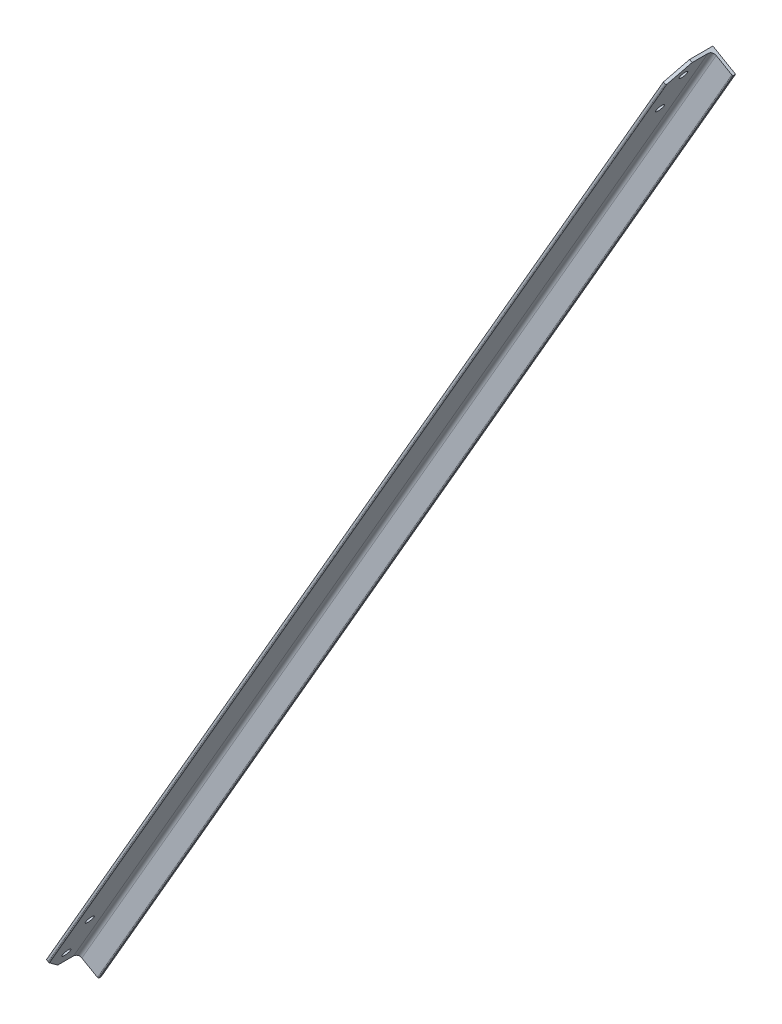
ISO-10303-21;
HEADER;
FILE_DESCRIPTION(('STEP AP214'),'2;1');
FILE_NAME('part.step','',(''),(''),'','','');
FILE_SCHEMA(('AUTOMOTIVE_DESIGN { 1 0 10303 214 1 1 1 1 }'));
ENDSEC;
DATA;
#1=APPLICATION_CONTEXT('core data for automotive mechanical design processes');
#2=APPLICATION_PROTOCOL_DEFINITION('international standard','automotive_design',2000,#1);
#3=PRODUCT_CONTEXT('',#1,'mechanical');
#4=PRODUCT('Part','Part','',(#3));
#5=PRODUCT_RELATED_PRODUCT_CATEGORY('part','',(#4));
#6=PRODUCT_DEFINITION_FORMATION('','',#4);
#7=PRODUCT_DEFINITION_CONTEXT('part definition',#1,'design');
#8=PRODUCT_DEFINITION('design','',#6,#7);
#9=PRODUCT_DEFINITION_SHAPE('','',#8);
#10=(LENGTH_UNIT() NAMED_UNIT(*) SI_UNIT(.MILLI.,.METRE.));
#11=(NAMED_UNIT(*) PLANE_ANGLE_UNIT() SI_UNIT($,.RADIAN.));
#12=(NAMED_UNIT(*) SI_UNIT($,.STERADIAN.) SOLID_ANGLE_UNIT());
#13=UNCERTAINTY_MEASURE_WITH_UNIT(LENGTH_MEASURE(1.E-05),#10,'distance_accuracy_value','');
#14=(GEOMETRIC_REPRESENTATION_CONTEXT(3) GLOBAL_UNCERTAINTY_ASSIGNED_CONTEXT((#13)) GLOBAL_UNIT_ASSIGNED_CONTEXT((#10,
#11,#12)) REPRESENTATION_CONTEXT('',''));
#15=CARTESIAN_POINT('',(0.,0.,0.));
#16=DIRECTION('',(0.,0.,1.));
#17=DIRECTION('',(1.,0.,0.));
#18=AXIS2_PLACEMENT_3D('',#15,#16,#17);
#19=CARTESIAN_POINT('',(2.88386459460233,-1.66499999999958,70.));
#20=DIRECTION('',(0.,0.,-1.));
#21=DIRECTION('',(-1.,0.,0.));
#22=AXIS2_PLACEMENT_3D('',#19,#20,#21);
#23=PLANE('',#22);
#24=DIRECTION('',(0.499999999999998,0.86602540378444,0.));
#25=VECTOR('',#24,1.);
#26=CARTESIAN_POINT('',(2.22044604925031E-13,4.44089209850063E-13,70.));
#27=LINE('',#26,#25);
#28=CARTESIAN_POINT('',(15.0000000000001,25.9807621135336,70.));
#29=VERTEX_POINT('',#28);
#30=CARTESIAN_POINT('',(1075.,1861.95461813655,70.));
#31=VERTEX_POINT('',#30);
#32=EDGE_CURVE('E167',#29,#31,#27,.T.);
#33=ORIENTED_EDGE('',*,*,#32,.F.);
#34=DIRECTION('',(0.86602540378444,-0.499999999999998,0.));
#35=VECTOR('',#34,1.);
#36=CARTESIAN_POINT('',(17.8838645946023,24.3157621135336,70.));
#37=LINE('',#36,#35);
#38=CARTESIAN_POINT('',(17.8838645946023,24.3157621135337,70.));
#39=VERTEX_POINT('',#38);
#40=EDGE_CURVE('E88',#29,#39,#37,.T.);
#41=ORIENTED_EDGE('',*,*,#40,.T.);
#42=DIRECTION('',(0.499999999999998,0.86602540378444,0.));
#43=VECTOR('',#42,1.);
#44=CARTESIAN_POINT('',(2.88386459460233,-1.66499999999958,70.));
#45=LINE('',#44,#43);
#46=CARTESIAN_POINT('',(1077.8838645946,1860.28961813655,70.));
#47=VERTEX_POINT('',#46);
#48=EDGE_CURVE('E186',#39,#47,#45,.T.);
#49=ORIENTED_EDGE('',*,*,#48,.T.);
#50=DIRECTION('',(-0.86602540378444,0.499999999999998,0.));
#51=VECTOR('',#50,1.);
#52=CARTESIAN_POINT('',(1077.8838645946,1860.28961813655,70.));
#53=LINE('',#52,#51);
#54=EDGE_CURVE('E218',#47,#31,#53,.T.);
#55=ORIENTED_EDGE('',*,*,#54,.T.);
#56=EDGE_LOOP('',(#33,#41,#49,#55));
#57=FACE_BOUND('',#56,.T.);
#58=ADVANCED_FACE('F66',(#57),#23,.F.);
#59=CARTESIAN_POINT('',(2.22044604925031E-13,4.44089209850063E-13,70.));
#60=DIRECTION('',(0.86602540378444,-0.499999999999998,0.));
#61=DIRECTION('',(0.499999999999998,0.86602540378444,0.));
#62=AXIS2_PLACEMENT_3D('',#59,#60,#61);
#63=PLANE('',#62);
#64=CARTESIAN_POINT('',(1035.,1792.67258583379,40.0047232344756));
#65=DIRECTION('',(-0.86602540378444,0.499999999999998,0.));
#66=DIRECTION('',(-0.499999999999998,-0.86602540378444,0.));
#67=AXIS2_PLACEMENT_3D('',#64,#65,#66);
#68=CIRCLE('',#67,7.00000000000019);
#69=CARTESIAN_POINT('',(1031.5,1786.6104080073,40.0047232344756));
#70=VERTEX_POINT('',#69);
#71=EDGE_CURVE('E456',#70,#70,#68,.T.);
#72=ORIENTED_EDGE('',*,*,#71,.F.);
#73=EDGE_LOOP('',(#72));
#74=FACE_BOUND('',#73,.T.);
#75=CARTESIAN_POINT('',(1075.,1861.95461813655,40.0047232344756));
#76=DIRECTION('',(-0.86602540378444,0.499999999999998,0.));
#77=DIRECTION('',(-0.499999999999998,-0.86602540378444,0.));
#78=AXIS2_PLACEMENT_3D('',#75,#76,#77);
#79=CIRCLE('',#78,6.9999999999998);
#80=CARTESIAN_POINT('',(1071.5,1855.89244031006,40.0047232344756));
#81=VERTEX_POINT('',#80);
#82=EDGE_CURVE('E457',#81,#81,#79,.T.);
#83=ORIENTED_EDGE('',*,*,#82,.F.);
#84=EDGE_LOOP('',(#83));
#85=FACE_BOUND('',#84,.T.);
#86=CARTESIAN_POINT('',(15.0000000000002,25.9807621135336,40.));
#87=DIRECTION('',(-0.86602540378444,0.499999999999998,0.));
#88=DIRECTION('',(-0.499999999999998,-0.86602540378444,0.));
#89=AXIS2_PLACEMENT_3D('',#86,#87,#88);
#90=CIRCLE('',#89,7.);
#91=CARTESIAN_POINT('',(11.5000000000002,19.9185842870425,40.));
#92=VERTEX_POINT('',#91);
#93=EDGE_CURVE('E445',#92,#92,#90,.T.);
#94=ORIENTED_EDGE('',*,*,#93,.F.);
#95=EDGE_LOOP('',(#94));
#96=FACE_BOUND('',#95,.T.);
#97=CARTESIAN_POINT('',(55.,95.2627944162888,40.));
#98=DIRECTION('',(-0.86602540378444,0.499999999999998,0.));
#99=DIRECTION('',(-0.499999999999998,-0.86602540378444,0.));
#100=AXIS2_PLACEMENT_3D('',#97,#98,#99);
#101=CIRCLE('',#100,7.);
#102=CARTESIAN_POINT('',(51.5,89.2006165897977,40.));
#103=VERTEX_POINT('',#102);
#104=EDGE_CURVE('E440',#103,#103,#101,.T.);
#105=ORIENTED_EDGE('',*,*,#104,.F.);
#106=EDGE_LOOP('',(#105));
#107=FACE_BOUND('',#106,.T.);
#108=DIRECTION('',(0.,0.,-1.));
#109=VECTOR('',#108,1.);
#110=CARTESIAN_POINT('',(2.22044604925031E-13,4.44089209850063E-13,70.));
#111=LINE('',#110,#109);
#112=CARTESIAN_POINT('',(2.22044604925031E-13,4.44089209850063E-13,40.0000000000002));
#113=VERTEX_POINT('',#112);
#114=CARTESIAN_POINT('',(2.22044604925031E-13,4.44089209850063E-13,0.));
#115=VERTEX_POINT('',#114);
#116=EDGE_CURVE('E148',#113,#115,#111,.T.);
#117=ORIENTED_EDGE('',*,*,#116,.F.);
#118=DIRECTION('',(0.353553390593273,0.612372435695796,0.707106781186546));
#119=VECTOR('',#118,1.);
#120=CARTESIAN_POINT('',(2.63677968348475E-13,5.20417042793042E-13,40.0000000000002));
#121=LINE('',#120,#119);
#122=EDGE_CURVE('E232',#113,#29,#121,.T.);
#123=ORIENTED_EDGE('',*,*,#122,.T.);
#124=ORIENTED_EDGE('',*,*,#32,.T.);
#125=DIRECTION('',(-0.353553390593271,-0.612372435695793,0.707106781186551));
#126=VECTOR('',#125,1.);
#127=CARTESIAN_POINT('',(1075.,1861.95461813655,70.));
#128=LINE('',#127,#126);
#129=CARTESIAN_POINT('',(1090.,1887.93538025008,39.9999999999995));
#130=VERTEX_POINT('',#129);
#131=EDGE_CURVE('E221',#31,#130,#128,.F.);
#132=ORIENTED_EDGE('',*,*,#131,.T.);
#133=DIRECTION('',(0.,0.,-1.));
#134=VECTOR('',#133,1.);
#135=CARTESIAN_POINT('',(1090.,1887.93538025008,70.));
#136=LINE('',#135,#134);
#137=CARTESIAN_POINT('',(1090.,1887.93538025008,0.));
#138=VERTEX_POINT('',#137);
#139=EDGE_CURVE('E164',#130,#138,#136,.T.);
#140=ORIENTED_EDGE('',*,*,#139,.T.);
#141=DIRECTION('',(0.499999999999998,0.86602540378444,0.));
#142=VECTOR('',#141,1.);
#143=CARTESIAN_POINT('',(2.22044604925031E-13,4.44089209850063E-13,0.));
#144=LINE('',#143,#142);
#145=EDGE_CURVE('E161',#115,#138,#144,.T.);
#146=ORIENTED_EDGE('',*,*,#145,.F.);
#147=EDGE_LOOP('',(#117,#123,#124,#132,#140,#146));
#148=FACE_BOUND('',#147,.T.);
#149=ADVANCED_FACE('F162',(#74,#85,#96,#107,#148),#63,.F.);
#150=CARTESIAN_POINT('',(2.22044604925031E-13,4.44089209850063E-13,0.));
#151=DIRECTION('',(0.,0.,1.));
#152=DIRECTION('',(1.,0.,0.));
#153=AXIS2_PLACEMENT_3D('',#150,#151,#152);
#154=PLANE('',#153);
#155=DIRECTION('',(0.866025403784439,-0.5,0.));
#156=VECTOR('',#155,1.);
#157=CARTESIAN_POINT('',(1090.,1887.93538025008,0.));
#158=LINE('',#157,#156);
#159=CARTESIAN_POINT('',(1128.9711431703,1865.43538025008,0.));
#160=VERTEX_POINT('',#159);
#161=EDGE_CURVE('E188',#138,#160,#158,.T.);
#162=ORIENTED_EDGE('',*,*,#161,.T.);
#163=DIRECTION('',(0.499999999999998,0.86602540378444,0.));
#164=VECTOR('',#163,1.);
#165=CARTESIAN_POINT('',(38.9711431702999,-22.4999999999995,0.));
#166=LINE('',#165,#164);
#167=CARTESIAN_POINT('',(38.9711431702999,-22.4999999999995,0.));
#168=VERTEX_POINT('',#167);
#169=EDGE_CURVE('E168',#168,#160,#166,.T.);
#170=ORIENTED_EDGE('',*,*,#169,.F.);
#171=DIRECTION('',(0.866025403784439,-0.5,0.));
#172=VECTOR('',#171,1.);
#173=CARTESIAN_POINT('',(2.22044604925031E-13,4.44089209850063E-13,0.));
#174=LINE('',#173,#172);
#175=EDGE_CURVE('E153',#115,#168,#174,.T.);
#176=ORIENTED_EDGE('',*,*,#175,.F.);
#177=ORIENTED_EDGE('',*,*,#145,.T.);
#178=EDGE_LOOP('',(#162,#170,#176,#177));
#179=FACE_BOUND('',#178,.T.);
#180=ADVANCED_FACE('F170',(#179),#154,.F.);
#181=CARTESIAN_POINT('',(38.9711431702999,-22.4999999999995,0.));
#182=DIRECTION('',(-0.86602540378444,0.499999999999998,0.));
#183=DIRECTION('',(-0.499999999999998,-0.86602540378444,0.));
#184=AXIS2_PLACEMENT_3D('',#181,#182,#183);
#185=PLANE('',#184);
#186=DIRECTION('',(0.,0.,1.));
#187=VECTOR('',#186,1.);
#188=CARTESIAN_POINT('',(1128.9711431703,1865.43538025008,0.));
#189=LINE('',#188,#187);
#190=CARTESIAN_POINT('',(1128.9711431703,1865.43538025008,3.33));
#191=VERTEX_POINT('',#190);
#192=EDGE_CURVE('E191',#160,#191,#189,.T.);
#193=ORIENTED_EDGE('',*,*,#192,.T.);
#194=DIRECTION('',(0.499999999999998,0.86602540378444,0.));
#195=VECTOR('',#194,1.);
#196=CARTESIAN_POINT('',(38.9711431702999,-22.4999999999995,3.33));
#197=LINE('',#196,#195);
#198=CARTESIAN_POINT('',(38.9711431702999,-22.4999999999995,3.33));
#199=VERTEX_POINT('',#198);
#200=EDGE_CURVE('E213',#199,#191,#197,.T.);
#201=ORIENTED_EDGE('',*,*,#200,.F.);
#202=DIRECTION('',(0.,0.,1.));
#203=VECTOR('',#202,1.);
#204=CARTESIAN_POINT('',(38.9711431702999,-22.4999999999995,0.));
#205=LINE('',#204,#203);
#206=EDGE_CURVE('E173',#168,#199,#205,.T.);
#207=ORIENTED_EDGE('',*,*,#206,.F.);
#208=ORIENTED_EDGE('',*,*,#169,.T.);
#209=EDGE_LOOP('',(#193,#201,#207,#208));
#210=FACE_BOUND('',#209,.T.);
#211=ADVANCED_FACE('F383',(#210),#185,.F.);
#212=CARTESIAN_POINT('',(37.52488074598,-21.6649999999994,3.33));
#213=DIRECTION('',(0.499999999999998,0.86602540378444,0.));
#214=DIRECTION('',(-0.86602540378444,0.499999999999998,0.));
#215=AXIS2_PLACEMENT_3D('',#212,#213,#214);
#216=CYLINDRICAL_SURFACE('',#215,1.66999999999998);
#217=CARTESIAN_POINT('',(1127.52488074598,1866.27038025008,3.33));
#218=DIRECTION('',(-0.499999999999998,-0.86602540378444,0.));
#219=DIRECTION('',(0.86602540378444,-0.499999999999998,0.));
#220=AXIS2_PLACEMENT_3D('',#217,#218,#219);
#221=CIRCLE('',#220,1.66999999999998);
#222=CARTESIAN_POINT('',(1127.52488074598,1866.27038025008,4.99999999999998));
#223=VERTEX_POINT('',#222);
#224=EDGE_CURVE('E193',#191,#223,#221,.T.);
#225=ORIENTED_EDGE('',*,*,#224,.T.);
#226=DIRECTION('',(0.499999999999998,0.86602540378444,0.));
#227=VECTOR('',#226,1.);
#228=CARTESIAN_POINT('',(37.52488074598,-21.6649999999994,4.99999999999998));
#229=LINE('',#228,#227);
#230=CARTESIAN_POINT('',(37.52488074598,-21.6649999999994,4.99999999999998));
#231=VERTEX_POINT('',#230);
#232=EDGE_CURVE('E210',#231,#223,#229,.T.);
#233=ORIENTED_EDGE('',*,*,#232,.F.);
#234=CARTESIAN_POINT('',(37.52488074598,-21.6649999999994,3.33));
#235=DIRECTION('',(-0.499999999999998,-0.86602540378444,0.));
#236=DIRECTION('',(0.86602540378444,-0.499999999999998,0.));
#237=AXIS2_PLACEMENT_3D('',#234,#235,#236);
#238=CIRCLE('',#237,1.66999999999998);
#239=EDGE_CURVE('E175',#199,#231,#238,.T.);
#240=ORIENTED_EDGE('',*,*,#239,.F.);
#241=ORIENTED_EDGE('',*,*,#200,.T.);
#242=EDGE_LOOP('',(#225,#233,#240,#241));
#243=FACE_BOUND('',#242,.T.);
#244=ADVANCED_FACE('F391',(#243),#216,.T.);
#245=CARTESIAN_POINT('',(37.52488074598,-21.6649999999994,5.));
#246=DIRECTION('',(0.,0.,-1.));
#247=DIRECTION('',(-1.,0.,0.));
#248=AXIS2_PLACEMENT_3D('',#245,#246,#247);
#249=PLANE('',#248);
#250=DIRECTION('',(-0.86602540378444,0.499999999999997,0.));
#251=VECTOR('',#250,1.);
#252=CARTESIAN_POINT('',(1127.52488074598,1866.27038025008,5.));
#253=LINE('',#252,#251);
#254=CARTESIAN_POINT('',(1100.8253175473,1881.68538025008,5.));
#255=VERTEX_POINT('',#254);
#256=EDGE_CURVE('E195',#223,#255,#253,.T.);
#257=ORIENTED_EDGE('',*,*,#256,.T.);
#258=DIRECTION('',(0.499999999999998,0.86602540378444,0.));
#259=VECTOR('',#258,1.);
#260=CARTESIAN_POINT('',(10.8253175473056,-6.24999999999942,5.));
#261=LINE('',#260,#259);
#262=CARTESIAN_POINT('',(10.8253175473056,-6.24999999999942,5.));
#263=VERTEX_POINT('',#262);
#264=EDGE_CURVE('E207',#263,#255,#261,.T.);
#265=ORIENTED_EDGE('',*,*,#264,.F.);
#266=DIRECTION('',(-0.86602540378444,0.499999999999997,0.));
#267=VECTOR('',#266,1.);
#268=CARTESIAN_POINT('',(37.52488074598,-21.6649999999994,5.));
#269=LINE('',#268,#267);
#270=EDGE_CURVE('E180',#231,#263,#269,.T.);
#271=ORIENTED_EDGE('',*,*,#270,.F.);
#272=ORIENTED_EDGE('',*,*,#232,.T.);
#273=EDGE_LOOP('',(#257,#265,#271,#272));
#274=FACE_BOUND('',#273,.T.);
#275=ADVANCED_FACE('F401',(#274),#249,.F.);
#276=CARTESIAN_POINT('',(10.8253175473056,-6.24999999999942,12.5));
#277=DIRECTION('',(0.499999999999998,0.86602540378444,0.));
#278=DIRECTION('',(-0.86602540378444,0.499999999999998,0.));
#279=AXIS2_PLACEMENT_3D('',#276,#277,#278);
#280=CYLINDRICAL_SURFACE('',#279,7.49999999999995);
#281=CARTESIAN_POINT('',(1100.8253175473,1881.68538025008,12.5));
#282=DIRECTION('',(0.499999999999998,0.86602540378444,0.));
#283=DIRECTION('',(-0.86602540378444,0.499999999999998,0.));
#284=AXIS2_PLACEMENT_3D('',#281,#282,#283);
#285=CIRCLE('',#284,7.49999999999995);
#286=CARTESIAN_POINT('',(1094.33012701892,1885.43538025008,12.5));
#287=VERTEX_POINT('',#286);
#288=EDGE_CURVE('E197',#255,#287,#285,.T.);
#289=ORIENTED_EDGE('',*,*,#288,.T.);
#290=DIRECTION('',(0.499999999999998,0.86602540378444,0.));
#291=VECTOR('',#290,1.);
#292=CARTESIAN_POINT('',(4.33012701892244,-2.4999999999995,12.5));
#293=LINE('',#292,#291);
#294=CARTESIAN_POINT('',(4.33012701892244,-2.4999999999995,12.5));
#295=VERTEX_POINT('',#294);
#296=EDGE_CURVE('E204',#295,#287,#293,.T.);
#297=ORIENTED_EDGE('',*,*,#296,.F.);
#298=CARTESIAN_POINT('',(10.8253175473056,-6.24999999999942,12.5));
#299=DIRECTION('',(0.499999999999998,0.86602540378444,0.));
#300=DIRECTION('',(-0.86602540378444,0.499999999999998,0.));
#301=AXIS2_PLACEMENT_3D('',#298,#299,#300);
#302=CIRCLE('',#301,7.49999999999995);
#303=EDGE_CURVE('E182',#263,#295,#302,.T.);
#304=ORIENTED_EDGE('',*,*,#303,.F.);
#305=ORIENTED_EDGE('',*,*,#264,.T.);
#306=EDGE_LOOP('',(#289,#297,#304,#305));
#307=FACE_BOUND('',#306,.T.);
#308=ADVANCED_FACE('F246',(#307),#280,.F.);
#309=CARTESIAN_POINT('',(4.33012701892244,-2.4999999999995,12.5));
#310=DIRECTION('',(-0.86602540378444,0.499999999999998,0.));
#311=DIRECTION('',(-0.499999999999998,-0.86602540378444,0.));
#312=AXIS2_PLACEMENT_3D('',#309,#310,#311);
#313=PLANE('',#312);
#314=CARTESIAN_POINT('',(1039.33012701892,1790.17258583379,40.0047232344756));
#315=DIRECTION('',(-0.86602540378444,0.499999999999998,0.));
#316=DIRECTION('',(-0.499999999999998,-0.86602540378444,0.));
#317=AXIS2_PLACEMENT_3D('',#314,#315,#316);
#318=CIRCLE('',#317,7.00000000000019);
#319=CARTESIAN_POINT('',(1035.83012701892,1784.1104080073,40.0047232344756));
#320=VERTEX_POINT('',#319);
#321=EDGE_CURVE('E448',#320,#320,#318,.F.);
#322=ORIENTED_EDGE('',*,*,#321,.F.);
#323=EDGE_LOOP('',(#322));
#324=FACE_BOUND('',#323,.T.);
#325=CARTESIAN_POINT('',(1079.33012701892,1859.45461813655,40.0047232344756));
#326=DIRECTION('',(-0.86602540378444,0.499999999999998,0.));
#327=DIRECTION('',(-0.499999999999998,-0.86602540378444,0.));
#328=AXIS2_PLACEMENT_3D('',#325,#326,#327);
#329=CIRCLE('',#328,6.9999999999998);
#330=CARTESIAN_POINT('',(1075.83012701892,1853.39244031006,40.0047232344756));
#331=VERTEX_POINT('',#330);
#332=EDGE_CURVE('E453',#331,#331,#329,.F.);
#333=ORIENTED_EDGE('',*,*,#332,.F.);
#334=EDGE_LOOP('',(#333));
#335=FACE_BOUND('',#334,.T.);
#336=CARTESIAN_POINT('',(19.3301270189222,23.4807621135337,40.));
#337=DIRECTION('',(-0.86602540378444,0.499999999999998,0.));
#338=DIRECTION('',(-0.499999999999998,-0.86602540378444,0.));
#339=AXIS2_PLACEMENT_3D('',#336,#337,#338);
#340=CIRCLE('',#339,7.);
#341=CARTESIAN_POINT('',(15.8301270189222,17.4185842870426,40.));
#342=VERTEX_POINT('',#341);
#343=EDGE_CURVE('E189',#342,#342,#340,.F.);
#344=ORIENTED_EDGE('',*,*,#343,.F.);
#345=EDGE_LOOP('',(#344));
#346=FACE_BOUND('',#345,.T.);
#347=CARTESIAN_POINT('',(59.3301270189222,92.7627944162889,40.));
#348=DIRECTION('',(-0.86602540378444,0.499999999999998,0.));
#349=DIRECTION('',(-0.499999999999998,-0.86602540378444,0.));
#350=AXIS2_PLACEMENT_3D('',#347,#348,#349);
#351=CIRCLE('',#350,7.);
#352=CARTESIAN_POINT('',(55.8301270189222,86.7006165897978,40.));
#353=VERTEX_POINT('',#352);
#354=EDGE_CURVE('E443',#353,#353,#351,.F.);
#355=ORIENTED_EDGE('',*,*,#354,.F.);
#356=EDGE_LOOP('',(#355));
#357=FACE_BOUND('',#356,.T.);
#358=DIRECTION('',(0.499999999999998,0.86602540378444,0.));
#359=VECTOR('',#358,1.);
#360=CARTESIAN_POINT('',(4.33012701892244,-2.4999999999995,68.33));
#361=LINE('',#360,#359);
#362=CARTESIAN_POINT('',(18.4951270189223,22.0344996892136,68.33));
#363=VERTEX_POINT('',#362);
#364=CARTESIAN_POINT('',(1080.16512701892,1860.90088056087,68.33));
#365=VERTEX_POINT('',#364);
#366=EDGE_CURVE('E202',#363,#365,#361,.T.);
#367=ORIENTED_EDGE('',*,*,#366,.F.);
#368=DIRECTION('',(-0.353553390593273,-0.612372435695796,-0.707106781186546));
#369=VECTOR('',#368,1.);
#370=CARTESIAN_POINT('',(4.33012701892245,-2.49999999999946,40.0000000000002));
#371=LINE('',#370,#369);
#372=CARTESIAN_POINT('',(4.33012701892244,-2.4999999999995,40.0000000000002));
#373=VERTEX_POINT('',#372);
#374=EDGE_CURVE('E13',#363,#373,#371,.T.);
#375=ORIENTED_EDGE('',*,*,#374,.T.);
#376=DIRECTION('',(0.,0.,1.));
#377=VECTOR('',#376,1.);
#378=CARTESIAN_POINT('',(4.33012701892244,-2.4999999999995,12.5));
#379=LINE('',#378,#377);
#380=EDGE_CURVE('E184',#295,#373,#379,.T.);
#381=ORIENTED_EDGE('',*,*,#380,.F.);
#382=ORIENTED_EDGE('',*,*,#296,.T.);
#383=DIRECTION('',(0.,0.,1.));
#384=VECTOR('',#383,1.);
#385=CARTESIAN_POINT('',(1094.33012701892,1885.43538025008,12.5));
#386=LINE('',#385,#384);
#387=CARTESIAN_POINT('',(1094.33012701892,1885.43538025008,39.9999999999995));
#388=VERTEX_POINT('',#387);
#389=EDGE_CURVE('E158',#287,#388,#386,.T.);
#390=ORIENTED_EDGE('',*,*,#389,.T.);
#391=DIRECTION('',(0.353553390593271,0.612372435695793,-0.707106781186551));
#392=VECTOR('',#391,1.);
#393=CARTESIAN_POINT('',(1079.33012701892,1859.45461813655,70.));
#394=LINE('',#393,#392);
#395=EDGE_CURVE('E225',#388,#365,#394,.F.);
#396=ORIENTED_EDGE('',*,*,#395,.T.);
#397=EDGE_LOOP('',(#367,#375,#381,#382,#390,#396));
#398=FACE_BOUND('',#397,.T.);
#399=ADVANCED_FACE('F240',(#324,#335,#346,#357,#398),#313,.F.);
#400=CARTESIAN_POINT('',(2.88386459460233,-1.66499999999958,68.33));
#401=DIRECTION('',(0.499999999999998,0.86602540378444,0.));
#402=DIRECTION('',(-0.86602540378444,0.499999999999998,0.));
#403=AXIS2_PLACEMENT_3D('',#400,#401,#402);
#404=CYLINDRICAL_SURFACE('',#403,1.67000000000002);
#405=ORIENTED_EDGE('',*,*,#48,.F.);
#406=CARTESIAN_POINT('',(17.0488645946023,22.8694996892136,68.33));
#407=DIRECTION('',(-0.353553390593272,-0.612372435695795,0.707106781186548));
#408=DIRECTION('',(0.353553390593273,0.612372435695796,0.707106781186547));
#409=AXIS2_PLACEMENT_3D('',#406,#407,#408);
#410=ELLIPSE('',#409,2.36173664916311,1.67000000000002);
#411=EDGE_CURVE('E74',#39,#363,#410,.F.);
#412=ORIENTED_EDGE('',*,*,#411,.T.);
#413=ORIENTED_EDGE('',*,*,#366,.T.);
#414=CARTESIAN_POINT('',(1078.7188645946,1861.73588056087,68.33));
#415=DIRECTION('',(-0.353553390593274,-0.612372435695798,-0.707106781186544));
#416=DIRECTION('',(0.353553390593271,0.612372435695793,-0.707106781186551));
#417=AXIS2_PLACEMENT_3D('',#414,#415,#416);
#418=ELLIPSE('',#417,2.36173664916309,1.67000000000002);
#419=EDGE_CURVE('E228',#365,#47,#418,.T.);
#420=ORIENTED_EDGE('',*,*,#419,.T.);
#421=EDGE_LOOP('',(#405,#412,#413,#420));
#422=FACE_BOUND('',#421,.T.);
#423=ADVANCED_FACE('F257',(#422),#404,.T.);
#424=CARTESIAN_POINT('',(37.52488074598,-21.6649999999994,3.33));
#425=DIRECTION('',(-0.499999999999998,-0.86602540378444,0.));
#426=DIRECTION('',(0.86602540378444,-0.499999999999998,0.));
#427=AXIS2_PLACEMENT_3D('',#424,#425,#426);
#428=PLANE('',#427);
#429=ORIENTED_EDGE('',*,*,#380,.T.);
#430=DIRECTION('',(-0.86602540378444,0.499999999999998,0.));
#431=VECTOR('',#430,1.);
#432=CARTESIAN_POINT('',(2.65412691824451E-13,5.17412413595568E-13,40.0000000000002));
#433=LINE('',#432,#431);
#434=EDGE_CURVE('E156',#373,#113,#433,.T.);
#435=ORIENTED_EDGE('',*,*,#434,.T.);
#436=ORIENTED_EDGE('',*,*,#116,.T.);
#437=ORIENTED_EDGE('',*,*,#175,.T.);
#438=ORIENTED_EDGE('',*,*,#206,.T.);
#439=ORIENTED_EDGE('',*,*,#239,.T.);
#440=ORIENTED_EDGE('',*,*,#270,.T.);
#441=ORIENTED_EDGE('',*,*,#303,.T.);
#442=EDGE_LOOP('',(#429,#435,#436,#437,#438,#439,#440,#441));
#443=FACE_BOUND('',#442,.T.);
#444=ADVANCED_FACE('F151',(#443),#428,.T.);
#445=CARTESIAN_POINT('',(1127.52488074598,1866.27038025008,3.33));
#446=DIRECTION('',(-0.499999999999998,-0.86602540378444,0.));
#447=DIRECTION('',(0.86602540378444,-0.499999999999998,0.));
#448=AXIS2_PLACEMENT_3D('',#445,#446,#447);
#449=PLANE('',#448);
#450=ORIENTED_EDGE('',*,*,#139,.F.);
#451=DIRECTION('',(0.86602540378444,-0.499999999999998,0.));
#452=VECTOR('',#451,1.);
#453=CARTESIAN_POINT('',(1127.52488074598,1866.27038025008,39.9999999999995));
#454=LINE('',#453,#452);
#455=EDGE_CURVE('E223',#130,#388,#454,.T.);
#456=ORIENTED_EDGE('',*,*,#455,.T.);
#457=ORIENTED_EDGE('',*,*,#389,.F.);
#458=ORIENTED_EDGE('',*,*,#288,.F.);
#459=ORIENTED_EDGE('',*,*,#256,.F.);
#460=ORIENTED_EDGE('',*,*,#224,.F.);
#461=ORIENTED_EDGE('',*,*,#192,.F.);
#462=ORIENTED_EDGE('',*,*,#161,.F.);
#463=EDGE_LOOP('',(#450,#456,#457,#458,#459,#460,#461,#462));
#464=FACE_BOUND('',#463,.T.);
#465=ADVANCED_FACE('F251',(#464),#449,.F.);
#466=CARTESIAN_POINT('',(911.472326183001,-399.221733658929,40.));
#467=DIRECTION('',(-0.86602540378444,0.499999999999998,0.));
#468=DIRECTION('',(-0.499999999999998,-0.86602540378444,0.));
#469=AXIS2_PLACEMENT_3D('',#466,#467,#468);
#470=CYLINDRICAL_SURFACE('',#469,7.);
#471=ORIENTED_EDGE('',*,*,#104,.T.);
#472=EDGE_LOOP('',(#471));
#473=FACE_BOUND('',#472,.T.);
#474=ORIENTED_EDGE('',*,*,#354,.T.);
#475=EDGE_LOOP('',(#474));
#476=FACE_BOUND('',#475,.T.);
#477=ADVANCED_FACE('F296',(#473,#476),#470,.F.);
#478=CARTESIAN_POINT('',(871.472326183001,-468.503765961684,40.));
#479=DIRECTION('',(-0.86602540378444,0.499999999999998,0.));
#480=DIRECTION('',(-0.499999999999998,-0.86602540378444,0.));
#481=AXIS2_PLACEMENT_3D('',#478,#479,#480);
#482=CYLINDRICAL_SURFACE('',#481,7.);
#483=ORIENTED_EDGE('',*,*,#93,.T.);
#484=EDGE_LOOP('',(#483));
#485=FACE_BOUND('',#484,.T.);
#486=ORIENTED_EDGE('',*,*,#343,.T.);
#487=EDGE_LOOP('',(#486));
#488=FACE_BOUND('',#487,.T.);
#489=ADVANCED_FACE('F288',(#485,#488),#482,.F.);
#490=CARTESIAN_POINT('',(1931.472326183,1367.47009006133,40.0047232344756));
#491=DIRECTION('',(-0.86602540378444,0.499999999999998,0.));
#492=DIRECTION('',(-0.499999999999998,-0.86602540378444,0.));
#493=AXIS2_PLACEMENT_3D('',#490,#491,#492);
#494=CYLINDRICAL_SURFACE('',#493,6.9999999999998);
#495=ORIENTED_EDGE('',*,*,#82,.T.);
#496=EDGE_LOOP('',(#495));
#497=FACE_BOUND('',#496,.T.);
#498=ORIENTED_EDGE('',*,*,#332,.T.);
#499=EDGE_LOOP('',(#498));
#500=FACE_BOUND('',#499,.T.);
#501=ADVANCED_FACE('F282',(#497,#500),#494,.F.);
#502=CARTESIAN_POINT('',(1891.472326183,1298.18805775857,40.0047232344756));
#503=DIRECTION('',(-0.86602540378444,0.499999999999998,0.));
#504=DIRECTION('',(-0.499999999999998,-0.86602540378444,0.));
#505=AXIS2_PLACEMENT_3D('',#502,#503,#504);
#506=CYLINDRICAL_SURFACE('',#505,7.00000000000019);
#507=ORIENTED_EDGE('',*,*,#71,.T.);
#508=EDGE_LOOP('',(#507));
#509=FACE_BOUND('',#508,.T.);
#510=ORIENTED_EDGE('',*,*,#321,.T.);
#511=EDGE_LOOP('',(#510));
#512=FACE_BOUND('',#511,.T.);
#513=ADVANCED_FACE('F277',(#509,#512),#506,.F.);
#514=CARTESIAN_POINT('',(1077.8838645946,1860.28961813655,70.));
#515=DIRECTION('',(-0.353553390593274,-0.612372435695798,-0.707106781186544));
#516=DIRECTION('',(-0.86602540378444,0.499999999999998,0.));
#517=AXIS2_PLACEMENT_3D('',#514,#515,#516);
#518=PLANE('',#517);
#519=ORIENTED_EDGE('',*,*,#395,.F.);
#520=ORIENTED_EDGE('',*,*,#455,.F.);
#521=ORIENTED_EDGE('',*,*,#131,.F.);
#522=ORIENTED_EDGE('',*,*,#54,.F.);
#523=ORIENTED_EDGE('',*,*,#419,.F.);
#524=EDGE_LOOP('',(#519,#520,#521,#522,#523));
#525=FACE_BOUND('',#524,.T.);
#526=ADVANCED_FACE('F255',(#525),#518,.F.);
#527=CARTESIAN_POINT('',(37.52488074598,-21.6649999999994,40.0000000000002));
#528=DIRECTION('',(-0.353553390593272,-0.612372435695795,0.707106781186548));
#529=DIRECTION('',(0.86602540378444,-0.499999999999998,0.));
#530=AXIS2_PLACEMENT_3D('',#527,#528,#529);
#531=PLANE('',#530);
#532=ORIENTED_EDGE('',*,*,#411,.F.);
#533=ORIENTED_EDGE('',*,*,#40,.F.);
#534=ORIENTED_EDGE('',*,*,#122,.F.);
#535=ORIENTED_EDGE('',*,*,#434,.F.);
#536=ORIENTED_EDGE('',*,*,#374,.F.);
#537=EDGE_LOOP('',(#532,#533,#534,#535,#536));
#538=FACE_BOUND('',#537,.T.);
#539=ADVANCED_FACE('F68',(#538),#531,.T.);
#540=CLOSED_SHELL('',(#58,#149,#180,#211,#244,#275,#308,#399,#423,#444,#465,#477,#489,#501,#513,
#526,#539));
#541=MANIFOLD_SOLID_BREP('B2',#540);
#542=ADVANCED_BREP_SHAPE_REPRESENTATION('',(#18,#541),#14);
#543=SHAPE_DEFINITION_REPRESENTATION(#9,#542);
ENDSEC;
END-ISO-10303-21;
